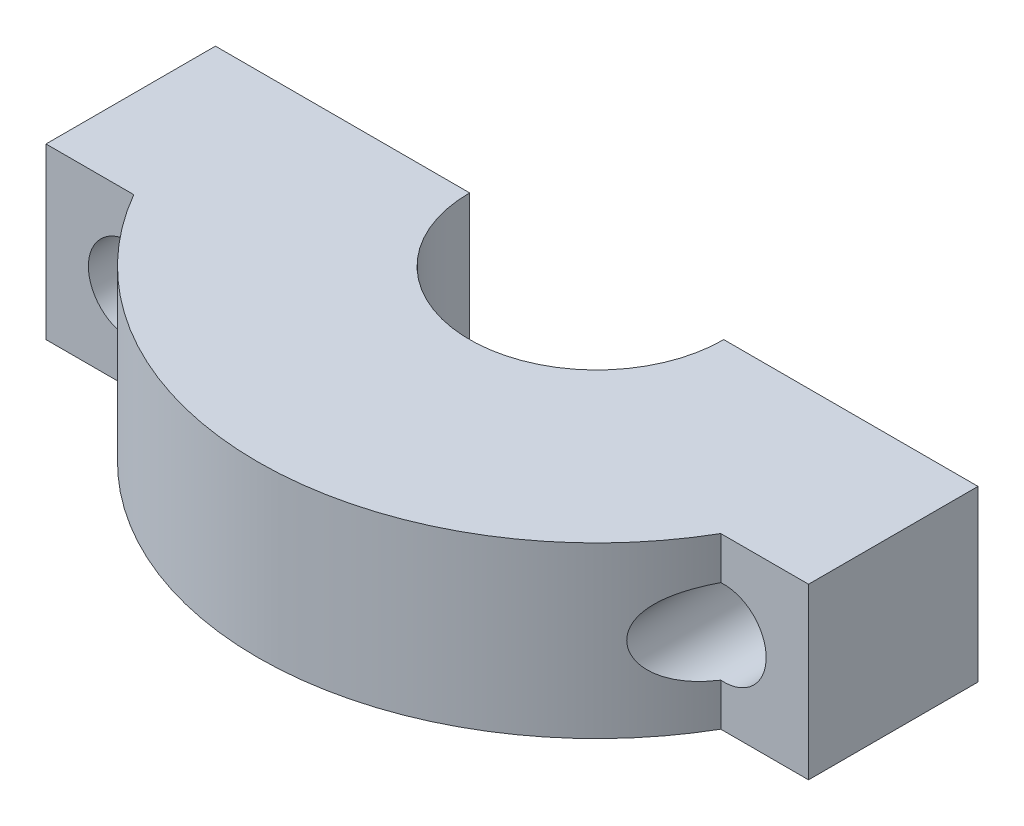
ISO-10303-21;
HEADER;
FILE_DESCRIPTION(('STEP AP214'),'2;1');
FILE_NAME('part.step','',(''),(''),'','','');
FILE_SCHEMA(('AUTOMOTIVE_DESIGN { 1 0 10303 214 1 1 1 1 }'));
ENDSEC;
DATA;
#1=APPLICATION_CONTEXT('core data for automotive mechanical design processes');
#2=APPLICATION_PROTOCOL_DEFINITION('international standard','automotive_design',2000,#1);
#3=PRODUCT_CONTEXT('',#1,'mechanical');
#4=PRODUCT('Part','Part','',(#3));
#5=PRODUCT_RELATED_PRODUCT_CATEGORY('part','',(#4));
#6=PRODUCT_DEFINITION_FORMATION('','',#4);
#7=PRODUCT_DEFINITION_CONTEXT('part definition',#1,'design');
#8=PRODUCT_DEFINITION('design','',#6,#7);
#9=PRODUCT_DEFINITION_SHAPE('','',#8);
#10=(LENGTH_UNIT() NAMED_UNIT(*) SI_UNIT(.MILLI.,.METRE.));
#11=(NAMED_UNIT(*) PLANE_ANGLE_UNIT() SI_UNIT($,.RADIAN.));
#12=(NAMED_UNIT(*) SI_UNIT($,.STERADIAN.) SOLID_ANGLE_UNIT());
#13=UNCERTAINTY_MEASURE_WITH_UNIT(LENGTH_MEASURE(1.E-05),#10,'distance_accuracy_value','');
#14=(GEOMETRIC_REPRESENTATION_CONTEXT(3) GLOBAL_UNCERTAINTY_ASSIGNED_CONTEXT((#13)) GLOBAL_UNIT_ASSIGNED_CONTEXT((#10,
#11,#12)) REPRESENTATION_CONTEXT('',''));
#15=CARTESIAN_POINT('',(0.,0.,0.));
#16=DIRECTION('',(0.,0.,1.));
#17=DIRECTION('',(1.,0.,0.));
#18=AXIS2_PLACEMENT_3D('',#15,#16,#17);
#19=CARTESIAN_POINT('',(0.,20.,20.));
#20=DIRECTION('',(0.,0.,-1.));
#21=DIRECTION('',(-1.,0.,0.));
#22=AXIS2_PLACEMENT_3D('',#19,#20,#21);
#23=PLANE('',#22);
#24=DIRECTION('',(0.,-1.,0.));
#25=VECTOR('',#24,1.);
#26=CARTESIAN_POINT('',(-34.6410161513775,20.,20.));
#27=LINE('',#26,#25);
#28=CARTESIAN_POINT('',(-34.6410161513775,5.01290359062228,20.));
#29=VERTEX_POINT('',#28);
#30=CARTESIAN_POINT('',(-34.6410161513775,0.,20.));
#31=VERTEX_POINT('',#30);
#32=EDGE_CURVE('E53',#29,#31,#27,.T.);
#33=ORIENTED_EDGE('',*,*,#32,.F.);
#34=CARTESIAN_POINT('',(-35.,10.,20.));
#35=DIRECTION('',(0.,0.,-1.));
#36=DIRECTION('',(-1.,0.,0.));
#37=AXIS2_PLACEMENT_3D('',#34,#35,#36);
#38=CIRCLE('',#37,5.);
#39=CARTESIAN_POINT('',(-34.6410161513745,14.9870964093775,20.0000000000053));
#40=VERTEX_POINT('',#39);
#41=EDGE_CURVE('E59',#29,#40,#38,.T.);
#42=ORIENTED_EDGE('',*,*,#41,.T.);
#43=CARTESIAN_POINT('',(-34.6410161513775,20.,20.));
#44=VERTEX_POINT('',#43);
#45=EDGE_CURVE('E11',#44,#40,#27,.T.);
#46=ORIENTED_EDGE('',*,*,#45,.F.);
#47=DIRECTION('',(1.,0.,0.));
#48=VECTOR('',#47,1.);
#49=CARTESIAN_POINT('',(0.,20.,20.));
#50=LINE('',#49,#48);
#51=CARTESIAN_POINT('',(-45.,20.,20.));
#52=VERTEX_POINT('',#51);
#53=EDGE_CURVE('E144',#52,#44,#50,.T.);
#54=ORIENTED_EDGE('',*,*,#53,.F.);
#55=DIRECTION('',(0.,-1.,0.));
#56=VECTOR('',#55,1.);
#57=CARTESIAN_POINT('',(-45.,20.,20.));
#58=LINE('',#57,#56);
#59=CARTESIAN_POINT('',(-45.,0.,20.));
#60=VERTEX_POINT('',#59);
#61=EDGE_CURVE('E185',#52,#60,#58,.T.);
#62=ORIENTED_EDGE('',*,*,#61,.T.);
#63=DIRECTION('',(1.,0.,0.));
#64=VECTOR('',#63,1.);
#65=CARTESIAN_POINT('',(0.,0.,20.));
#66=LINE('',#65,#64);
#67=EDGE_CURVE('E186',#60,#31,#66,.T.);
#68=ORIENTED_EDGE('',*,*,#67,.T.);
#69=EDGE_LOOP('',(#33,#42,#46,#54,#62,#68));
#70=FACE_BOUND('',#69,.T.);
#71=ADVANCED_FACE('F45',(#70),#23,.F.);
#72=CARTESIAN_POINT('',(0.,20.,0.));
#73=DIRECTION('',(0.,-1.,0.));
#74=DIRECTION('',(0.,0.,-1.));
#75=AXIS2_PLACEMENT_3D('',#72,#73,#74);
#76=CYLINDRICAL_SURFACE('',#75,40.);
#77=DIRECTION('',(0.,-1.,0.));
#78=VECTOR('',#77,1.);
#79=CARTESIAN_POINT('',(34.6410161513776,20.,20.));
#80=LINE('',#79,#78);
#81=CARTESIAN_POINT('',(34.6410161513776,5.01290359062228,20.));
#82=VERTEX_POINT('',#81);
#83=CARTESIAN_POINT('',(34.6410161513776,0.,20.));
#84=VERTEX_POINT('',#83);
#85=EDGE_CURVE('E228',#82,#84,#80,.T.);
#86=ORIENTED_EDGE('',*,*,#85,.F.);
#87=CARTESIAN_POINT('',(40.,10.,0.));
#88=CARTESIAN_POINT('',(40.,9.9998279055008,-2.47190046126606E-08));
#89=CARTESIAN_POINT('',(39.9999999911474,9.99965581077223,0.000800864393686338));
#90=CARTESIAN_POINT('',(39.9999999397677,9.9991560985,0.00270700168119621));
#91=CARTESIAN_POINT('',(39.9999998740511,9.99882836977865,0.00343404615297465));
#92=CARTESIAN_POINT('',(39.9999994903405,9.99754421897714,0.00656066357744848));
#93=CARTESIAN_POINT('',(39.9999989302323,9.99659082605299,0.00948779175975535));
#94=CARTESIAN_POINT('',(39.9999954866459,9.99265149974106,0.0212688272919127));
#95=CARTESIAN_POINT('',(39.9999901954597,9.98965893265132,0.0294756221291241));
#96=CARTESIAN_POINT('',(39.9998810957546,9.94871520772489,0.142180833480209));
#97=CARTESIAN_POINT('',(39.9993485220816,9.91081365955477,0.251466856547122));
#98=CARTESIAN_POINT('',(39.9974056861191,9.83442061306678,0.469182731514124));
#99=CARTESIAN_POINT('',(39.9959821256488,9.7959289570599,0.577573929433425));
#100=CARTESIAN_POINT('',(39.9903474807692,9.67990064539974,0.905157132911895));
#101=CARTESIAN_POINT('',(39.9847737220887,9.60241675267333,1.1250653613084));
#102=CARTESIAN_POINT('',(39.9703365304885,9.45112039795943,1.55456245920803));
#103=CARTESIAN_POINT('',(39.9616302418824,9.37729775360283,1.76417575894534));
#104=CARTESIAN_POINT('',(39.9409530540826,9.23027840446942,2.18261845639082));
#105=CARTESIAN_POINT('',(39.9289957160726,9.15708037412016,2.39144753609374));
#106=CARTESIAN_POINT('',(39.9001032472244,9.00202340826933,2.83499007127384));
#107=CARTESIAN_POINT('',(39.8827338391875,8.92022022226965,3.0696907453156));
#108=CARTESIAN_POINT('',(39.8438096528888,8.75720540730894,3.53926248741331));
#109=CARTESIAN_POINT('',(39.8222500666148,8.67599457017416,3.77413343943947));
#110=CARTESIAN_POINT('',(39.7508163037109,8.43198576297174,4.48329312886489));
#111=CARTESIAN_POINT('',(39.6944940513055,8.27047254759791,4.95739441244998));
#112=CARTESIAN_POINT('',(39.5820947785782,7.99495489411175,5.77754692594184));
#113=CARTESIAN_POINT('',(39.5300166403151,7.87984386222982,6.12378230202411));
#114=CARTESIAN_POINT('',(39.4167441007881,7.6530012999934,6.81487950238481));
#115=CARTESIAN_POINT('',(39.3555731728897,7.54126193369747,7.15974258244789));
#116=CARTESIAN_POINT('',(39.2254864094548,7.32401067674265,7.84082880194199));
#117=CARTESIAN_POINT('',(39.156784509126,7.21841432218095,8.17706583988161));
#118=CARTESIAN_POINT('',(39.0104080222068,7.01123333468589,8.84909085581892));
#119=CARTESIAN_POINT('',(38.9327272361893,6.90965153930965,9.18487835966053));
#120=CARTESIAN_POINT('',(38.7569589103481,6.69745814713723,9.90215804407074));
#121=CARTESIAN_POINT('',(38.6575353026289,6.5875474747963,10.2835317713008));
#122=CARTESIAN_POINT('',(38.4469098348601,6.37492033746572,11.0449595031631));
#123=CARTESIAN_POINT('',(38.335710032465,6.27220262084443,11.4250137264058));
#124=CARTESIAN_POINT('',(38.1005161594307,6.07436718288156,12.18649479155));
#125=CARTESIAN_POINT('',(37.9764316519615,5.97931284390281,12.5679102623475));
#126=CARTESIAN_POINT('',(37.7160730825146,5.79904560165965,13.3288989430705));
#127=CARTESIAN_POINT('',(37.5797994246853,5.71383237231397,13.7084722136369));
#128=CARTESIAN_POINT('',(37.2859732925955,5.54978606552597,14.4893420151934));
#129=CARTESIAN_POINT('',(37.1276202966661,5.47169661878623,14.8904952836562));
#130=CARTESIAN_POINT('',(36.796982799346,5.33061396811713,15.6897770679195));
#131=CARTESIAN_POINT('',(36.624697051776,5.26762211655515,16.0879053096626));
#132=CARTESIAN_POINT('',(36.2667840164395,5.15953413208649,16.8792296784654));
#133=CARTESIAN_POINT('',(36.081196247423,5.11438739054768,17.272436646077));
#134=CARTESIAN_POINT('',(35.6965448306921,5.0448993902054,18.0539824445407));
#135=CARTESIAN_POINT('',(35.4974854141435,5.02055163130025,18.4423227589087));
#136=CARTESIAN_POINT('',(35.1003267165308,4.99732354398818,19.1867857116139));
#137=CARTESIAN_POINT('',(34.9030780012357,4.99682791987585,19.543307084171));
#138=CARTESIAN_POINT('',(34.4980213707573,5.02112228680366,20.2497501745335));
#139=CARTESIAN_POINT('',(34.2902080603652,5.04592532335154,20.5996683925427));
#140=CARTESIAN_POINT('',(33.8686912963593,5.12501783907216,21.2854659996719));
#141=CARTESIAN_POINT('',(33.6551244316466,5.17885576119279,21.6214776654527));
#142=CARTESIAN_POINT('',(33.330124996286,5.28571627184832,22.1165509652102));
#143=CARTESIAN_POINT('',(33.22105257989,5.3256701191704,22.2800339004006));
#144=CARTESIAN_POINT('',(33.0017686570632,5.41512253960919,22.6035705386505));
#145=CARTESIAN_POINT('',(32.8915574109744,5.4646189750115,22.7636250008447));
#146=CARTESIAN_POINT('',(32.6829587216465,5.56792400155548,23.0619497330375));
#147=CARTESIAN_POINT('',(32.584633964924,5.62062341554228,23.200647224237));
#148=CARTESIAN_POINT('',(32.3880217905223,5.73496741745363,23.474335411928));
#149=CARTESIAN_POINT('',(32.2897343703084,5.79661121319054,23.6093264354368));
#150=CARTESIAN_POINT('',(32.0934850575852,5.92982992921299,23.8754190771132));
#151=CARTESIAN_POINT('',(31.9955254257495,6.00143807158056,24.0065058254116));
#152=CARTESIAN_POINT('',(31.80107645195,6.15523025519245,24.2635013100602));
#153=CARTESIAN_POINT('',(31.7045871188478,6.23741436015018,24.3894100152101));
#154=CARTESIAN_POINT('',(31.512911695646,6.41427425371427,24.6365815318141));
#155=CARTESIAN_POINT('',(31.4177567082955,6.50909260301499,24.7577671510366));
#156=CARTESIAN_POINT('',(31.2313103001844,6.71124780696219,24.9925534807886));
#157=CARTESIAN_POINT('',(31.1400196645105,6.81858718891968,25.106152652728));
#158=CARTESIAN_POINT('',(30.9633040882411,7.04606403191407,25.3237707975302));
#159=CARTESIAN_POINT('',(30.8778590627394,7.16615363363012,25.4278230418236));
#160=CARTESIAN_POINT('',(30.7145489314425,7.41975395404233,25.6248485579371));
#161=CARTESIAN_POINT('',(30.6366805961209,7.55325890474894,25.7178265539212));
#162=CARTESIAN_POINT('',(30.4768057604529,7.86081027900466,25.9071891807588));
#163=CARTESIAN_POINT('',(30.3968749949148,8.03771925364028,26.0008006904327));
#164=CARTESIAN_POINT('',(30.2910773925128,8.31597648478149,26.1238125554603));
#165=CARTESIAN_POINT('',(30.258154357486,8.41090499998313,26.1619234815804));
#166=CARTESIAN_POINT('',(30.1975679460175,8.60467491135068,26.2318322605907));
#167=CARTESIAN_POINT('',(30.1699024848761,8.70351473776631,26.2636326159302));
#168=CARTESIAN_POINT('',(30.1201636754038,8.90542155552193,26.3206608811109));
#169=CARTESIAN_POINT('',(30.0981403687122,9.00851754999924,26.3458300293857));
#170=CARTESIAN_POINT('',(30.0604966817369,9.21734172793896,26.3887732993438));
#171=CARTESIAN_POINT('',(30.0448731244859,9.32306857767233,26.4065510903148));
#172=CARTESIAN_POINT('',(30.0203936970193,9.53628394253061,26.4343773805243));
#173=CARTESIAN_POINT('',(30.0115359446226,9.64377195921056,26.4444280293836));
#174=CARTESIAN_POINT('',(30.0008066736178,9.85953897767697,26.4565996872647));
#175=CARTESIAN_POINT('',(29.998934395866,9.96781789223138,26.4587215579437));
#176=CARTESIAN_POINT('',(30.0020312800172,10.1717004814106,26.4552096817251));
#177=CARTESIAN_POINT('',(30.006239834906,10.2673324807883,26.4504381846447));
#178=CARTESIAN_POINT('',(30.0200800851879,10.4577231478062,26.4347290823205));
#179=CARTESIAN_POINT('',(30.0297134969098,10.5524815294011,26.42378952561));
#180=CARTESIAN_POINT('',(30.0542143570426,10.7403886111653,26.3959190488026));
#181=CARTESIAN_POINT('',(30.069079814642,10.8335379094733,26.3789904075602));
#182=CARTESIAN_POINT('',(30.1037649934854,11.0176835382249,26.3394005741208));
#183=CARTESIAN_POINT('',(30.1235866662212,11.1086790051194,26.3167371238212));
#184=CARTESIAN_POINT('',(30.1899004086659,11.3772462402071,26.2407020906195));
#185=CARTESIAN_POINT('',(30.2433107545209,11.5509119907956,26.1792074593278));
#186=CARTESIAN_POINT('',(30.3653296399985,11.8845450178642,26.0375782473402));
#187=CARTESIAN_POINT('',(30.4339440603307,12.0445069606293,25.9574364535977));
#188=CARTESIAN_POINT('',(30.620155541085,12.4251580495587,25.7378248938764));
#189=CARTESIAN_POINT('',(30.7451717657884,12.6366353352194,25.5886403679231));
#190=CARTESIAN_POINT('',(31.0125405041995,13.0259342616429,25.2639404470697));
#191=CARTESIAN_POINT('',(31.154937908814,13.2036655892327,25.0883565869839));
#192=CARTESIAN_POINT('',(31.4124337956617,13.4865601394455,24.7647020640719));
#193=CARTESIAN_POINT('',(31.5253508310886,13.5987169809365,24.6208729927673));
#194=CARTESIAN_POINT('',(31.754657300821,13.8068018602006,24.3244084019038));
#195=CARTESIAN_POINT('',(31.8710484624793,13.9027216612315,24.1717684650944));
#196=CARTESIAN_POINT('',(32.10549846609,14.079634701338,23.8594863913968));
#197=CARTESIAN_POINT('',(32.2235565933878,14.1606341396378,23.6998471968998));
#198=CARTESIAN_POINT('',(32.4601653759868,14.3091467250344,23.3747331223032));
#199=CARTESIAN_POINT('',(32.5787161893107,14.3766551387025,23.2092562178728));
#200=CARTESIAN_POINT('',(32.8941485070964,14.5403502621322,22.7616315768769));
#201=CARTESIAN_POINT('',(33.0906042472022,14.6256851980321,22.4751924811858));
#202=CARTESIAN_POINT('',(33.4790966355515,14.7675596063744,21.8923060370337));
#203=CARTESIAN_POINT('',(33.6711299699012,14.8240781155098,21.5958515693032));
#204=CARTESIAN_POINT('',(34.0507957520112,14.9129841491872,20.992184200719));
#205=CARTESIAN_POINT('',(34.2383597375935,14.9451088299465,20.6848904458325));
#206=CARTESIAN_POINT('',(34.6056303467268,14.9878484885677,20.0644043855026));
#207=CARTESIAN_POINT('',(34.7853398027611,14.9984712840654,19.75121426567));
#208=CARTESIAN_POINT('',(35.1212903689692,15.0011040671351,19.1469090223937));
#209=CARTESIAN_POINT('',(35.278227466606,14.9946203914925,18.8561821744164));
#210=CARTESIAN_POINT('',(35.5846233456078,14.9680844860457,18.2713867571991));
#211=CARTESIAN_POINT('',(35.7340808515908,14.9480299506163,17.9773176284697));
#212=CARTESIAN_POINT('',(36.025536945808,14.8959400452665,17.3859013133494));
#213=CARTESIAN_POINT('',(36.1675214329137,14.8638828907788,17.0885491264671));
#214=CARTESIAN_POINT('',(36.4436282961933,14.7891941880578,16.4915183992084));
#215=CARTESIAN_POINT('',(36.5777496579639,14.7465612791661,16.1918395642992));
#216=CARTESIAN_POINT('',(36.9565695477614,14.6088948438739,15.3167734680179));
#217=CARTESIAN_POINT('',(37.1907934864269,14.5014874663311,14.7387240810177));
#218=CARTESIAN_POINT('',(37.5197769865799,14.3204448684463,13.8694533507431));
#219=CARTESIAN_POINT('',(37.6254607567659,14.2569707121461,13.5801037910108));
#220=CARTESIAN_POINT('',(37.8297365068994,14.1240091123961,13.0002123450564));
#221=CARTESIAN_POINT('',(37.9283272644109,14.0545206369409,12.7096702623877));
#222=CARTESIAN_POINT('',(38.1666885462634,13.8735596752172,11.9798565632806));
#223=CARTESIAN_POINT('',(38.3019575601018,13.758681167618,11.5399544438455));
#224=CARTESIAN_POINT('',(38.5565094624568,13.5187792488841,10.6586051264853));
#225=CARTESIAN_POINT('',(38.6758011925349,13.3937615106454,10.2171589229829));
#226=CARTESIAN_POINT('',(38.9011903896765,13.1322796648128,9.32281250548751));
#227=CARTESIAN_POINT('',(39.0069286228128,12.9956206877467,8.86987895612984));
#228=CARTESIAN_POINT('',(39.2024061798573,12.7146176856513,7.96163764526148));
#229=CARTESIAN_POINT('',(39.29210428862,12.5702550663555,7.50632677587828));
#230=CARTESIAN_POINT('',(39.428780288757,12.3235346294136,6.74306024488239));
#231=CARTESIAN_POINT('',(39.4801621642293,12.2227925696198,6.43536087698295));
#232=CARTESIAN_POINT('',(39.575632184388,12.0189746006362,5.81949040397283));
#233=CARTESIAN_POINT('',(39.6197180175325,11.9158979635164,5.51131918045857));
#234=CARTESIAN_POINT('',(39.7002055951508,11.708881358762,4.89779835784258));
#235=CARTESIAN_POINT('',(39.7366806943227,11.6049607309525,4.59245181883906));
#236=CARTESIAN_POINT('',(39.8024985967151,11.3957156044557,3.98186785446081));
#237=CARTESIAN_POINT('',(39.8318496457212,11.2903928790908,3.6766307152114));
#238=CARTESIAN_POINT('',(39.8806403535906,11.0902969045448,3.09980519064193));
#239=CARTESIAN_POINT('',(39.9008177200151,10.9956472491493,2.82823439220211));
#240=CARTESIAN_POINT('',(39.9356840417317,10.805250652654,2.28380895206543));
#241=CARTESIAN_POINT('',(39.9503498998714,10.7095007894267,2.01095365487752));
#242=CARTESIAN_POINT('',(39.9684147439862,10.5633874329095,1.59569540917297));
#243=CARTESIAN_POINT('',(39.9738488992424,10.5131978744562,1.45325474848949));
#244=CARTESIAN_POINT('',(39.9832115527474,10.4125165545713,1.1675242592471));
#245=CARTESIAN_POINT('',(39.9871337792796,10.3620243983011,1.02423334500613));
#246=CARTESIAN_POINT('',(39.993410562863,10.2614617025194,0.739999957295029));
#247=CARTESIAN_POINT('',(39.9957801830909,10.211391909795,0.599048254819121));
#248=CARTESIAN_POINT('',(39.9989888825666,10.1120146486926,0.315804131742135));
#249=CARTESIAN_POINT('',(39.9998506610486,10.0627071519942,0.173564588014665));
#250=CARTESIAN_POINT('',(39.9999901964796,10.0103406480341,0.0294780084238295));
#251=CARTESIAN_POINT('',(39.9999954880079,10.0073477282481,0.0212671182243732));
#252=CARTESIAN_POINT('',(39.9999989307636,10.0034083123772,0.00948527039841699));
#253=CARTESIAN_POINT('',(39.9999994905628,10.0024552091108,0.00655921100931305));
#254=CARTESIAN_POINT('',(39.9999998740926,10.0011714283981,0.00343344082005648));
#255=CARTESIAN_POINT('',(39.9999999397835,10.0008437759683,0.00270653189952217));
#256=CARTESIAN_POINT('',(39.9999999911491,10.0003441566242,0.000800813672317605));
#257=CARTESIAN_POINT('',(40.,10.0001720784268,2.47166960265759E-08));
#258=CARTESIAN_POINT('',(40.,10.,0.));
#259=B_SPLINE_CURVE_WITH_KNOTS('',3,(#87,#88,#89,#90,#91,#92,#93,#94,#95,#96,#97,#98,#99,#100,
#101,#102,#103,#104,#105,#106,#107,#108,#109,#110,#111,#112,#113,#114,#115,#116,#117,#118,#119,
#120,#121,#122,#123,#124,#125,#126,#127,#128,#129,#130,#131,#132,#133,#134,#135,#136,#137,#138,
#139,#140,#141,#142,#143,#144,#145,#146,#147,#148,#149,#150,#151,#152,#153,#154,#155,#156,#157,
#158,#159,#160,#161,#162,#163,#164,#165,#166,#167,#168,#169,#170,#171,#172,#173,#174,#175,#176,
#177,#178,#179,#180,#181,#182,#183,#184,#185,#186,#187,#188,#189,#190,#191,#192,#193,#194,#195,
#196,#197,#198,#199,#200,#201,#202,#203,#204,#205,#206,#207,#208,#209,#210,#211,#212,#213,#214,
#215,#216,#217,#218,#219,#220,#221,#222,#223,#224,#225,#226,#227,#228,#229,#230,#231,#232,#233,
#234,#235,#236,#237,#238,#239,#240,#241,#242,#243,#244,#245,#246,#247,#248,#249,#250,#251,#252,
#253,#254,#255,#256,#257,#258),.UNSPECIFIED.,.T.,.F.,(4,2,2,2,2,2,2,2,2,2,2,2,2,2,2,2,2,2,2,2,2,
2,2,2,2,2,2,2,2,2,2,2,2,2,2,2,2,2,2,2,2,2,2,2,2,2,2,2,2,2,2,2,2,2,2,2,2,2,2,2,2,2,2,2,2,2,2,2,2,
2,2,2,2,2,2,2,2,2,2,2,2,2,2,2,2,4),(0.,0.00154623091854211,0.00448869176509149,
0.0130899190486982,0.0400000062659372,0.381306718255352,0.727833130823128,1.4263351595306,
2.0938061851684,2.75853459178979,3.5059830591916,4.25429430320176,5.7659886882833,
6.87157505260465,7.97435534071228,9.0514127739913,10.1292183490489,11.3564682004791,
12.5835039672567,13.8198235924047,15.0561022408311,16.370516800251,17.6850490544142,
18.9958260848521,20.3061933210017,21.5276865229,22.7498099185977,23.9534527185668,
24.5548899797484,25.1561926642011,25.6899414625931,26.2236430166466,26.7591686316124,
27.2946974729294,27.8368822670203,28.3791766885245,28.9195030648295,29.4595981114078,
30.1033856245126,30.4254518821881,30.7473901685274,31.0720919949702,31.3966324368323,
31.7210825617907,32.0454974262245,32.332675305003,32.619944092878,32.9071036919509,
33.1943765376236,33.7673692446955,34.3405839648717,35.1979923402558,36.0576639866938,
36.7003514257308,37.3433639171865,37.9861086393991,38.6290784790952,39.7003476602681,
40.7723950578524,41.8558359917271,42.9388829383297,43.9298065927372,44.9208986426787,
45.9137982985397,46.90682576548,48.8037603618863,49.7472158493891,50.6908335479159,
52.1134586019262,53.535293117295,54.9892698239239,56.4469304632659,57.4303171254602,
58.4140147515478,59.3877418955441,60.3603365588874,61.2252083116453,62.0936651138773,
62.5471631956034,63.0025227182958,63.453396284708,63.8974219862591,63.9243355386215,
63.9329341251054,63.9358759060123,63.9374219925235),.UNSPECIFIED.);
#260=CARTESIAN_POINT('',(34.6410161513776,14.9870964093777,20.));
#261=VERTEX_POINT('',#260);
#262=EDGE_CURVE('E66',#82,#261,#259,.T.);
#263=ORIENTED_EDGE('',*,*,#262,.T.);
#264=CARTESIAN_POINT('',(34.6410161513776,20.,20.));
#265=VERTEX_POINT('',#264);
#266=EDGE_CURVE('E139',#265,#261,#80,.T.);
#267=ORIENTED_EDGE('',*,*,#266,.F.);
#268=CARTESIAN_POINT('',(0.,20.,0.));
#269=DIRECTION('',(0.,1.,0.));
#270=DIRECTION('',(0.,0.,1.));
#271=AXIS2_PLACEMENT_3D('',#268,#269,#270);
#272=CIRCLE('',#271,40.);
#273=EDGE_CURVE('E136',#44,#265,#272,.T.);
#274=ORIENTED_EDGE('',*,*,#273,.F.);
#275=ORIENTED_EDGE('',*,*,#45,.T.);
#276=CARTESIAN_POINT('',(-40.,10.,0.));
#277=CARTESIAN_POINT('',(-40.,10.0001720944992,-2.47190086754575E-08));
#278=CARTESIAN_POINT('',(-39.9999999911474,10.0003441892278,0.000800864393688849));
#279=CARTESIAN_POINT('',(-39.9999999397677,10.0008439015,0.00270700168120876));
#280=CARTESIAN_POINT('',(-39.9999998740511,10.0011716302214,0.00343404615299186));
#281=CARTESIAN_POINT('',(-39.9999994903405,10.0024557810229,0.00656066357746287));
#282=CARTESIAN_POINT('',(-39.9999989302323,10.003409173947,0.00948779175976106));
#283=CARTESIAN_POINT('',(-39.9999954866459,10.0073485002589,0.0212688272919247));
#284=CARTESIAN_POINT('',(-39.9999901954597,10.0103410673487,0.0294756221291295));
#285=CARTESIAN_POINT('',(-39.9998810957546,10.0512847922755,0.142180833480228));
#286=CARTESIAN_POINT('',(-39.9993485220816,10.0891863404453,0.251466856547363));
#287=CARTESIAN_POINT('',(-39.9974056861191,10.1655793869331,0.469182731514672));
#288=CARTESIAN_POINT('',(-39.9959821256488,10.2040710429402,0.577573929434055));
#289=CARTESIAN_POINT('',(-39.9903474807692,10.3200993546006,0.90515713291279));
#290=CARTESIAN_POINT('',(-39.9847737220887,10.3975832473271,1.1250653613095));
#291=CARTESIAN_POINT('',(-39.9703365304885,10.5488796020412,1.55456245920968));
#292=CARTESIAN_POINT('',(-39.9616302418823,10.6227022463979,1.76417575894733));
#293=CARTESIAN_POINT('',(-39.9409530540825,10.7697215955315,2.18261845639347));
#294=CARTESIAN_POINT('',(-39.9289957160725,10.8429196258808,2.39144753609671));
#295=CARTESIAN_POINT('',(-39.9001032472242,10.9979765917317,2.83499007127695));
#296=CARTESIAN_POINT('',(-39.8827338391873,11.0797797777313,3.06969074531852));
#297=CARTESIAN_POINT('',(-39.8438096528886,11.2427945926919,3.53926248741586));
#298=CARTESIAN_POINT('',(-39.8222500666146,11.3240054298266,3.77413343944183));
#299=CARTESIAN_POINT('',(-39.7508163037107,11.5680142370288,4.48329312886662));
#300=CARTESIAN_POINT('',(-39.6944940513053,11.7295274524025,4.95739441245124));
#301=CARTESIAN_POINT('',(-39.5820947785781,12.0050451058885,5.77754692594249));
#302=CARTESIAN_POINT('',(-39.5300166403151,12.1201561377704,6.1237823020246));
#303=CARTESIAN_POINT('',(-39.4167441007881,12.3469987000067,6.81487950238498));
#304=CARTESIAN_POINT('',(-39.3555731728897,12.4587380663025,7.15974258244791));
#305=CARTESIAN_POINT('',(-39.2254864094548,12.6759893232573,7.84082880194189));
#306=CARTESIAN_POINT('',(-39.156784509126,12.781585677819,8.17706583988153));
#307=CARTESIAN_POINT('',(-39.0104080222068,12.9887666653141,8.84909085581888));
#308=CARTESIAN_POINT('',(-38.9327272361893,13.0903484606903,9.18487835966051));
#309=CARTESIAN_POINT('',(-38.7569589103481,13.3025418528628,9.90215804407076));
#310=CARTESIAN_POINT('',(-38.6575353026289,13.4124525252037,10.2835317713008));
#311=CARTESIAN_POINT('',(-38.4469098348601,13.6250796625343,11.0449595031631));
#312=CARTESIAN_POINT('',(-38.3357100324649,13.7277973791556,11.4250137264059));
#313=CARTESIAN_POINT('',(-38.1005161594307,13.9256328171185,12.18649479155));
#314=CARTESIAN_POINT('',(-37.9764316519615,14.0206871560972,12.5679102623476));
#315=CARTESIAN_POINT('',(-37.7160730825146,14.2009543983403,13.3288989430704));
#316=CARTESIAN_POINT('',(-37.5797994246853,14.286167627686,13.7084722136368));
#317=CARTESIAN_POINT('',(-37.2859732925956,14.450213934474,14.4893420151933));
#318=CARTESIAN_POINT('',(-37.1276202966662,14.5283033812137,14.8904952836561));
#319=CARTESIAN_POINT('',(-36.796982799346,14.6693860318829,15.6897770679194));
#320=CARTESIAN_POINT('',(-36.6246970517761,14.7323778834448,16.0879053096625));
#321=CARTESIAN_POINT('',(-36.2667840164395,14.8404658679135,16.8792296784653));
#322=CARTESIAN_POINT('',(-36.081196247423,14.8856126094523,17.272436646077));
#323=CARTESIAN_POINT('',(-35.6965448306921,14.9551006097946,18.0539824445407));
#324=CARTESIAN_POINT('',(-35.4974854141435,14.9794483686998,18.4423227589087));
#325=CARTESIAN_POINT('',(-35.1003267165308,15.0026764560118,19.1867857116139));
#326=CARTESIAN_POINT('',(-34.9030780012357,15.0031720801242,19.543307084171));
#327=CARTESIAN_POINT('',(-34.4980213707573,14.9788777131963,20.2497501745335));
#328=CARTESIAN_POINT('',(-34.2902080603652,14.9540746766485,20.5996683925427));
#329=CARTESIAN_POINT('',(-33.8686912963593,14.8749821609278,21.2854659996719));
#330=CARTESIAN_POINT('',(-33.6551244316466,14.8211442388072,21.6214776654527));
#331=CARTESIAN_POINT('',(-33.330124996286,14.7142837281517,22.1165509652102));
#332=CARTESIAN_POINT('',(-33.22105257989,14.6743298808296,22.2800339004006));
#333=CARTESIAN_POINT('',(-33.0017686570632,14.5848774603908,22.6035705386505));
#334=CARTESIAN_POINT('',(-32.8915574109744,14.5353810249885,22.7636250008447));
#335=CARTESIAN_POINT('',(-32.6829587216465,14.4320759984445,23.0619497330375));
#336=CARTESIAN_POINT('',(-32.5846339649239,14.3793765844577,23.200647224237));
#337=CARTESIAN_POINT('',(-32.3880217905222,14.2650325825464,23.474335411928));
#338=CARTESIAN_POINT('',(-32.2897343703084,14.2033887868095,23.6093264354368));
#339=CARTESIAN_POINT('',(-32.0934850575851,14.070170070787,23.8754190771132));
#340=CARTESIAN_POINT('',(-31.9955254257495,13.9985619284194,24.0065058254116));
#341=CARTESIAN_POINT('',(-31.80107645195,13.8447697448076,24.2635013100602));
#342=CARTESIAN_POINT('',(-31.7045871188477,13.7625856398498,24.3894100152101));
#343=CARTESIAN_POINT('',(-31.512911695646,13.5857257462857,24.6365815318141));
#344=CARTESIAN_POINT('',(-31.4177567082955,13.490907396985,24.7577671510367));
#345=CARTESIAN_POINT('',(-31.2313103001844,13.2887521930378,24.9925534807887));
#346=CARTESIAN_POINT('',(-31.1400196645105,13.1814128110803,25.106152652728));
#347=CARTESIAN_POINT('',(-30.9633040882411,12.9539359680859,25.3237707975302));
#348=CARTESIAN_POINT('',(-30.8778590627393,12.8338463663699,25.4278230418237));
#349=CARTESIAN_POINT('',(-30.7145489314425,12.5802460459577,25.6248485579371));
#350=CARTESIAN_POINT('',(-30.6366805961209,12.4467410952511,25.7178265539212));
#351=CARTESIAN_POINT('',(-30.4768057604529,12.1391897209953,25.9071891807588));
#352=CARTESIAN_POINT('',(-30.3968749949148,11.9622807463597,26.0008006904328));
#353=CARTESIAN_POINT('',(-30.2910773925128,11.6840235152185,26.1238125554604));
#354=CARTESIAN_POINT('',(-30.258154357486,11.5890950000169,26.1619234815805));
#355=CARTESIAN_POINT('',(-30.1975679460175,11.3953250886493,26.2318322605907));
#356=CARTESIAN_POINT('',(-30.1699024848761,11.2964852622337,26.2636326159302));
#357=CARTESIAN_POINT('',(-30.1201636754038,11.0945784444781,26.3206608811109));
#358=CARTESIAN_POINT('',(-30.0981403687122,10.9914824500008,26.3458300293857));
#359=CARTESIAN_POINT('',(-30.0604966817369,10.782658272061,26.3887732993438));
#360=CARTESIAN_POINT('',(-30.0448731244859,10.6769314223277,26.4065510903148));
#361=CARTESIAN_POINT('',(-30.0203936970193,10.4637160574694,26.4343773805243));
#362=CARTESIAN_POINT('',(-30.0115359446225,10.3562280407894,26.4444280293836));
#363=CARTESIAN_POINT('',(-30.0008066736178,10.140461022323,26.4565996872647));
#364=CARTESIAN_POINT('',(-29.998934395866,10.0321821077686,26.4587215579437));
#365=CARTESIAN_POINT('',(-30.0020312800172,9.8282995185894,26.4552096817251));
#366=CARTESIAN_POINT('',(-30.006239834906,9.73266751921171,26.4504381846448));
#367=CARTESIAN_POINT('',(-30.0200800851879,9.54227685219376,26.4347290823205));
#368=CARTESIAN_POINT('',(-30.0297134969098,9.44751847059893,26.42378952561));
#369=CARTESIAN_POINT('',(-30.0542143570426,9.25961138883467,26.3959190488026));
#370=CARTESIAN_POINT('',(-30.069079814642,9.1664620905267,26.3789904075602));
#371=CARTESIAN_POINT('',(-30.1037649934854,8.98231646177511,26.3394005741208));
#372=CARTESIAN_POINT('',(-30.1235866662212,8.8913209948806,26.3167371238212));
#373=CARTESIAN_POINT('',(-30.1899004086659,8.62275375979288,26.2407020906195));
#374=CARTESIAN_POINT('',(-30.2433107545209,8.44908800920438,26.1792074593278));
#375=CARTESIAN_POINT('',(-30.3653296399985,8.11545498213579,26.0375782473402));
#376=CARTESIAN_POINT('',(-30.4339440603307,7.95549303937069,25.9574364535978));
#377=CARTESIAN_POINT('',(-30.620155541085,7.57484195044131,25.7378248938765));
#378=CARTESIAN_POINT('',(-30.7451717657884,7.36336466478057,25.5886403679231));
#379=CARTESIAN_POINT('',(-31.0125405041995,6.97406573835706,25.2639404470697));
#380=CARTESIAN_POINT('',(-31.154937908814,6.79633441076732,25.0883565869839));
#381=CARTESIAN_POINT('',(-31.4124337956617,6.51343986055451,24.7647020640719));
#382=CARTESIAN_POINT('',(-31.5253508310886,6.40128301906345,24.6208729927673));
#383=CARTESIAN_POINT('',(-31.754657300821,6.19319813979939,24.3244084019038));
#384=CARTESIAN_POINT('',(-31.8710484624793,6.09727833876851,24.1717684650944));
#385=CARTESIAN_POINT('',(-32.1054984660901,5.92036529866194,23.8594863913968));
#386=CARTESIAN_POINT('',(-32.2235565933879,5.83936586036223,23.6998471968998));
#387=CARTESIAN_POINT('',(-32.4601653759868,5.69085327496556,23.3747331223032));
#388=CARTESIAN_POINT('',(-32.5787161893107,5.62334486129746,23.2092562178728));
#389=CARTESIAN_POINT('',(-32.8941485070964,5.45964973786784,22.7616315768768));
#390=CARTESIAN_POINT('',(-33.0906042472023,5.37431480196787,22.4751924811858));
#391=CARTESIAN_POINT('',(-33.4790966355515,5.23244039362557,21.8923060370337));
#392=CARTESIAN_POINT('',(-33.6711299699012,5.17592188449017,21.5958515693031));
#393=CARTESIAN_POINT('',(-34.0507957520113,5.08701585081277,20.9921842007189));
#394=CARTESIAN_POINT('',(-34.2383597375935,5.0548911700535,20.6848904458325));
#395=CARTESIAN_POINT('',(-34.6056303467269,5.01215151143229,20.0644043855026));
#396=CARTESIAN_POINT('',(-34.7853398027611,5.00152871593457,19.75121426567));
#397=CARTESIAN_POINT('',(-35.1212903689693,4.99889593286494,19.1469090223936));
#398=CARTESIAN_POINT('',(-35.2782274666061,5.00537960850748,18.8561821744163));
#399=CARTESIAN_POINT('',(-35.5846233456079,5.03191551395435,18.2713867571989));
#400=CARTESIAN_POINT('',(-35.7340808515909,5.05197004938372,17.9773176284695));
#401=CARTESIAN_POINT('',(-36.0255369458081,5.10405995473353,17.3859013133492));
#402=CARTESIAN_POINT('',(-36.1675214329138,5.13611710922123,17.0885491264669));
#403=CARTESIAN_POINT('',(-36.4436282961935,5.21080581194226,16.4915183992082));
#404=CARTESIAN_POINT('',(-36.577749657964,5.25343872083399,16.191839564299));
#405=CARTESIAN_POINT('',(-36.9565695477615,5.39110515612614,15.3167734680177));
#406=CARTESIAN_POINT('',(-37.1907934864269,5.49851253366894,14.7387240810176));
#407=CARTESIAN_POINT('',(-37.5197769865799,5.67955513155371,13.8694533507431));
#408=CARTESIAN_POINT('',(-37.6254607567659,5.74302928785395,13.5801037910108));
#409=CARTESIAN_POINT('',(-37.8297365068994,5.87599088760396,13.0002123450564));
#410=CARTESIAN_POINT('',(-37.928327264411,5.94547936305918,12.7096702623876));
#411=CARTESIAN_POINT('',(-38.1666885462635,6.12644032478292,11.9798565632803));
#412=CARTESIAN_POINT('',(-38.3019575601019,6.24131883238218,11.5399544438451));
#413=CARTESIAN_POINT('',(-38.556509462457,6.48122075111607,10.6586051264845));
#414=CARTESIAN_POINT('',(-38.6758011925351,6.60623848935485,10.217158922982));
#415=CARTESIAN_POINT('',(-38.9011903896767,6.86772033518749,9.32281250548658));
#416=CARTESIAN_POINT('',(-39.006928622813,7.00437931225354,8.86987895612898));
#417=CARTESIAN_POINT('',(-39.2024061798575,7.28538231434898,7.96163764526073));
#418=CARTESIAN_POINT('',(-39.2921042886202,7.42974493364475,7.50632677587757));
#419=CARTESIAN_POINT('',(-39.4287802887571,7.6764653705865,6.74306024488195));
#420=CARTESIAN_POINT('',(-39.4801621642293,7.77720743038028,6.43536087698275));
#421=CARTESIAN_POINT('',(-39.5756321843879,7.98102539936373,5.81949040397309));
#422=CARTESIAN_POINT('',(-39.6197180175325,8.08410203648345,5.51131918045907));
#423=CARTESIAN_POINT('',(-39.7002055951507,8.29111864123769,4.89779835784358));
#424=CARTESIAN_POINT('',(-39.7366806943225,8.39503926904708,4.59245181884033));
#425=CARTESIAN_POINT('',(-39.8024985967149,8.60428439554371,3.98186785446258));
#426=CARTESIAN_POINT('',(-39.831849645721,8.7096071209085,3.67663071521341));
#427=CARTESIAN_POINT('',(-39.8806403535905,8.9097030954545,3.09980519064386));
#428=CARTESIAN_POINT('',(-39.9008177200149,9.00435275085013,2.82823439220374));
#429=CARTESIAN_POINT('',(-39.9356840417316,9.19474934734564,2.28380895206647));
#430=CARTESIAN_POINT('',(-39.9503498998714,9.29049921057307,2.01095365487829));
#431=CARTESIAN_POINT('',(-39.9684147439862,9.43661256709029,1.59569540917341));
#432=CARTESIAN_POINT('',(-39.9738488992424,9.48680212554349,1.45325474848988));
#433=CARTESIAN_POINT('',(-39.9832115527473,9.5874834454287,1.16752425924758));
#434=CARTESIAN_POINT('',(-39.9871337792796,9.63797560169929,1.02423334500673));
#435=CARTESIAN_POINT('',(-39.993410562863,9.73853829747989,0.739999957295178));
#436=CARTESIAN_POINT('',(-39.9957801830909,9.78860809020277,0.5990482548187));
#437=CARTESIAN_POINT('',(-39.9989888825666,9.88798535130963,0.315804131743163));
#438=CARTESIAN_POINT('',(-39.9998506610486,9.93729284801383,0.173564588017671));
#439=CARTESIAN_POINT('',(-39.9999901964796,9.98965935196549,0.0294780084236863));
#440=CARTESIAN_POINT('',(-39.9999954880079,9.99265227175103,0.0212671182240365));
#441=CARTESIAN_POINT('',(-39.9999989307636,9.99659168762231,0.00948527039820522));
#442=CARTESIAN_POINT('',(-39.9999994905628,9.99754479088884,0.00655921100915388));
#443=CARTESIAN_POINT('',(-39.9999998740926,9.99882857160175,0.00343344081995984));
#444=CARTESIAN_POINT('',(-39.9999999397835,9.99915622403163,0.00270653189944406));
#445=CARTESIAN_POINT('',(-39.9999999911491,9.99965584337578,0.000800813672292238));
#446=CARTESIAN_POINT('',(-40.,9.99982792157323,2.47167000883123E-08));
#447=CARTESIAN_POINT('',(-40.,10.,0.));
#448=B_SPLINE_CURVE_WITH_KNOTS('',3,(#276,#277,#278,#279,#280,#281,#282,#283,#284,#285,#286,
#287,#288,#289,#290,#291,#292,#293,#294,#295,#296,#297,#298,#299,#300,#301,#302,#303,#304,#305,
#306,#307,#308,#309,#310,#311,#312,#313,#314,#315,#316,#317,#318,#319,#320,#321,#322,#323,#324,
#325,#326,#327,#328,#329,#330,#331,#332,#333,#334,#335,#336,#337,#338,#339,#340,#341,#342,#343,
#344,#345,#346,#347,#348,#349,#350,#351,#352,#353,#354,#355,#356,#357,#358,#359,#360,#361,#362,
#363,#364,#365,#366,#367,#368,#369,#370,#371,#372,#373,#374,#375,#376,#377,#378,#379,#380,#381,
#382,#383,#384,#385,#386,#387,#388,#389,#390,#391,#392,#393,#394,#395,#396,#397,#398,#399,#400,
#401,#402,#403,#404,#405,#406,#407,#408,#409,#410,#411,#412,#413,#414,#415,#416,#417,#418,#419,
#420,#421,#422,#423,#424,#425,#426,#427,#428,#429,#430,#431,#432,#433,#434,#435,#436,#437,#438,
#439,#440,#441,#442,#443,#444,#445,#446,#447),.UNSPECIFIED.,.T.,.F.,(4,2,2,2,2,2,2,2,2,2,2,2,2,
2,2,2,2,2,2,2,2,2,2,2,2,2,2,2,2,2,2,2,2,2,2,2,2,2,2,2,2,2,2,2,2,2,2,2,2,2,2,2,2,2,2,2,2,2,2,2,2,
2,2,2,2,2,2,2,2,2,2,2,2,2,2,2,2,2,2,2,2,2,2,2,2,4),(0.,0.00154623091855933,0.0044886917651288,
0.0130899190486911,0.0400000062659372,0.381306718255729,0.727833130823859,1.42633515953202,
2.09380618517085,2.75853459179327,3.50598305919449,4.25429430320406,5.76598868828417,
6.871575052605,7.97435534071214,9.05141277399123,10.1292183490489,11.3564682004792,
12.5835039672568,13.8198235924047,15.0561022408309,16.3705168002509,17.6850490544141,
18.995826084852,20.3061933210017,21.5276865229,22.7498099185977,23.9534527185668,
24.5548899797484,25.1561926642011,25.6899414625931,26.2236430166467,26.7591686316124,
27.2946974729294,27.8368822670203,28.3791766885246,28.9195030648295,29.4595981114078,
30.1033856245126,30.4254518821881,30.7473901685274,31.0720919949702,31.3966324368323,
31.7210825617907,32.0454974262246,32.3326753050031,32.619944092878,32.907103691951,
33.1943765376236,33.7673692446955,34.3405839648718,35.1979923402558,36.0576639866938,
36.7003514257309,37.3433639171866,37.9861086393992,38.6290784790953,39.7003476602681,
40.7723950578525,41.8558359917271,42.9388829383298,43.9298065927374,44.920898642679,
45.91379829854,46.9068257654803,48.8037603618863,49.7472158493892,50.6908335479161,
52.1134586019269,53.5352931172961,54.9892698239248,56.4469304632667,57.4303171254602,
58.4140147515471,59.3877418955425,60.3603365588851,61.2252083116439,62.0936651138769,
62.5471631956029,63.0025227182954,63.4533962847077,63.8974219862592,63.9243355386216,
63.9329341251055,63.9358759060124,63.9374219925235),.UNSPECIFIED.);
#449=EDGE_CURVE('E119',#40,#29,#448,.T.);
#450=ORIENTED_EDGE('',*,*,#449,.T.);
#451=ORIENTED_EDGE('',*,*,#32,.T.);
#452=CARTESIAN_POINT('',(0.,0.,0.));
#453=DIRECTION('',(0.,1.,0.));
#454=DIRECTION('',(0.,0.,1.));
#455=AXIS2_PLACEMENT_3D('',#452,#453,#454);
#456=CIRCLE('',#455,40.);
#457=EDGE_CURVE('E189',#31,#84,#456,.T.);
#458=ORIENTED_EDGE('',*,*,#457,.T.);
#459=EDGE_LOOP('',(#86,#263,#267,#274,#275,#450,#451,#458));
#460=FACE_BOUND('',#459,.T.);
#461=ADVANCED_FACE('F134',(#460),#76,.T.);
#462=CARTESIAN_POINT('',(0.,20.,20.));
#463=DIRECTION('',(0.,0.,-1.));
#464=DIRECTION('',(-1.,0.,0.));
#465=AXIS2_PLACEMENT_3D('',#462,#463,#464);
#466=PLANE('',#465);
#467=ORIENTED_EDGE('',*,*,#266,.T.);
#468=CARTESIAN_POINT('',(35.,10.,20.));
#469=DIRECTION('',(0.,0.,-1.));
#470=DIRECTION('',(-1.,0.,0.));
#471=AXIS2_PLACEMENT_3D('',#468,#469,#470);
#472=CIRCLE('',#471,5.);
#473=EDGE_CURVE('E131',#261,#82,#472,.T.);
#474=ORIENTED_EDGE('',*,*,#473,.T.);
#475=ORIENTED_EDGE('',*,*,#85,.T.);
#476=DIRECTION('',(1.,0.,0.));
#477=VECTOR('',#476,1.);
#478=CARTESIAN_POINT('',(0.,0.,20.));
#479=LINE('',#478,#477);
#480=CARTESIAN_POINT('',(45.,0.,20.));
#481=VERTEX_POINT('',#480);
#482=EDGE_CURVE('E193',#84,#481,#479,.T.);
#483=ORIENTED_EDGE('',*,*,#482,.T.);
#484=DIRECTION('',(0.,-1.,0.));
#485=VECTOR('',#484,1.);
#486=CARTESIAN_POINT('',(45.,20.,20.));
#487=LINE('',#486,#485);
#488=CARTESIAN_POINT('',(45.,20.,20.));
#489=VERTEX_POINT('',#488);
#490=EDGE_CURVE('E225',#489,#481,#487,.T.);
#491=ORIENTED_EDGE('',*,*,#490,.F.);
#492=DIRECTION('',(1.,0.,0.));
#493=VECTOR('',#492,1.);
#494=CARTESIAN_POINT('',(0.,20.,20.));
#495=LINE('',#494,#493);
#496=EDGE_CURVE('E143',#265,#489,#495,.T.);
#497=ORIENTED_EDGE('',*,*,#496,.F.);
#498=EDGE_LOOP('',(#467,#474,#475,#483,#491,#497));
#499=FACE_BOUND('',#498,.T.);
#500=ADVANCED_FACE('F233',(#499),#466,.F.);
#501=CARTESIAN_POINT('',(45.,20.,0.));
#502=DIRECTION('',(-1.,0.,0.));
#503=DIRECTION('',(0.,0.,1.));
#504=AXIS2_PLACEMENT_3D('',#501,#502,#503);
#505=PLANE('',#504);
#506=DIRECTION('',(0.,0.,-1.));
#507=VECTOR('',#506,1.);
#508=CARTESIAN_POINT('',(45.,0.,0.));
#509=LINE('',#508,#507);
#510=CARTESIAN_POINT('',(45.,0.,0.));
#511=VERTEX_POINT('',#510);
#512=EDGE_CURVE('E196',#481,#511,#509,.T.);
#513=ORIENTED_EDGE('',*,*,#512,.T.);
#514=DIRECTION('',(0.,-1.,0.));
#515=VECTOR('',#514,1.);
#516=CARTESIAN_POINT('',(45.,20.,0.));
#517=LINE('',#516,#515);
#518=CARTESIAN_POINT('',(45.,20.,0.));
#519=VERTEX_POINT('',#518);
#520=EDGE_CURVE('E222',#519,#511,#517,.T.);
#521=ORIENTED_EDGE('',*,*,#520,.F.);
#522=DIRECTION('',(0.,0.,-1.));
#523=VECTOR('',#522,1.);
#524=CARTESIAN_POINT('',(45.,20.,0.));
#525=LINE('',#524,#523);
#526=EDGE_CURVE('E168',#489,#519,#525,.T.);
#527=ORIENTED_EDGE('',*,*,#526,.F.);
#528=ORIENTED_EDGE('',*,*,#490,.T.);
#529=EDGE_LOOP('',(#513,#521,#527,#528));
#530=FACE_BOUND('',#529,.T.);
#531=ADVANCED_FACE('F244',(#530),#505,.F.);
#532=CARTESIAN_POINT('',(0.,20.,0.));
#533=DIRECTION('',(0.,0.,-1.));
#534=DIRECTION('',(-1.,0.,0.));
#535=AXIS2_PLACEMENT_3D('',#532,#533,#534);
#536=PLANE('',#535);
#537=CARTESIAN_POINT('',(35.,10.,0.));
#538=DIRECTION('',(0.,0.,-1.));
#539=DIRECTION('',(-1.,0.,0.));
#540=AXIS2_PLACEMENT_3D('',#537,#538,#539);
#541=CIRCLE('',#540,5.);
#542=CARTESIAN_POINT('',(30.,10.,0.));
#543=VERTEX_POINT('',#542);
#544=EDGE_CURVE('E124',#543,#543,#541,.T.);
#545=ORIENTED_EDGE('',*,*,#544,.F.);
#546=EDGE_LOOP('',(#545));
#547=FACE_BOUND('',#546,.T.);
#548=DIRECTION('',(1.,0.,0.));
#549=VECTOR('',#548,1.);
#550=CARTESIAN_POINT('',(0.,0.,0.));
#551=LINE('',#550,#549);
#552=CARTESIAN_POINT('',(15.,0.,0.));
#553=VERTEX_POINT('',#552);
#554=EDGE_CURVE('E200',#553,#511,#551,.T.);
#555=ORIENTED_EDGE('',*,*,#554,.F.);
#556=DIRECTION('',(0.,-1.,0.));
#557=VECTOR('',#556,1.);
#558=CARTESIAN_POINT('',(15.,20.,0.));
#559=LINE('',#558,#557);
#560=CARTESIAN_POINT('',(15.,20.,0.));
#561=VERTEX_POINT('',#560);
#562=EDGE_CURVE('E219',#561,#553,#559,.T.);
#563=ORIENTED_EDGE('',*,*,#562,.F.);
#564=DIRECTION('',(1.,0.,0.));
#565=VECTOR('',#564,1.);
#566=CARTESIAN_POINT('',(0.,20.,0.));
#567=LINE('',#566,#565);
#568=EDGE_CURVE('E171',#561,#519,#567,.T.);
#569=ORIENTED_EDGE('',*,*,#568,.T.);
#570=ORIENTED_EDGE('',*,*,#520,.T.);
#571=EDGE_LOOP('',(#555,#563,#569,#570));
#572=FACE_BOUND('',#571,.T.);
#573=ADVANCED_FACE('F352',(#547,#572),#536,.T.);
#574=CARTESIAN_POINT('',(0.,20.,0.));
#575=DIRECTION('',(0.,-1.,0.));
#576=DIRECTION('',(0.,0.,-1.));
#577=AXIS2_PLACEMENT_3D('',#574,#575,#576);
#578=CYLINDRICAL_SURFACE('',#577,15.);
#579=CARTESIAN_POINT('',(0.,0.,0.));
#580=DIRECTION('',(0.,1.,0.));
#581=DIRECTION('',(0.,0.,1.));
#582=AXIS2_PLACEMENT_3D('',#579,#580,#581);
#583=CIRCLE('',#582,15.);
#584=CARTESIAN_POINT('',(-15.,0.,0.));
#585=VERTEX_POINT('',#584);
#586=EDGE_CURVE('E204',#585,#553,#583,.T.);
#587=ORIENTED_EDGE('',*,*,#586,.F.);
#588=DIRECTION('',(0.,-1.,0.));
#589=VECTOR('',#588,1.);
#590=CARTESIAN_POINT('',(-15.,20.,0.));
#591=LINE('',#590,#589);
#592=CARTESIAN_POINT('',(-15.,20.,0.));
#593=VERTEX_POINT('',#592);
#594=EDGE_CURVE('E216',#593,#585,#591,.T.);
#595=ORIENTED_EDGE('',*,*,#594,.F.);
#596=CARTESIAN_POINT('',(0.,20.,0.));
#597=DIRECTION('',(0.,1.,0.));
#598=DIRECTION('',(0.,0.,1.));
#599=AXIS2_PLACEMENT_3D('',#596,#597,#598);
#600=CIRCLE('',#599,15.);
#601=EDGE_CURVE('E175',#593,#561,#600,.T.);
#602=ORIENTED_EDGE('',*,*,#601,.T.);
#603=ORIENTED_EDGE('',*,*,#562,.T.);
#604=EDGE_LOOP('',(#587,#595,#602,#603));
#605=FACE_BOUND('',#604,.T.);
#606=ADVANCED_FACE('F251',(#605),#578,.F.);
#607=CARTESIAN_POINT('',(0.,20.,0.));
#608=DIRECTION('',(0.,0.,-1.));
#609=DIRECTION('',(-1.,0.,0.));
#610=AXIS2_PLACEMENT_3D('',#607,#608,#609);
#611=PLANE('',#610);
#612=CARTESIAN_POINT('',(-35.,10.,0.));
#613=DIRECTION('',(0.,0.,-1.));
#614=DIRECTION('',(1.,0.,0.));
#615=AXIS2_PLACEMENT_3D('',#612,#613,#614);
#616=CIRCLE('',#615,5.);
#617=CARTESIAN_POINT('',(-30.,10.,0.));
#618=VERTEX_POINT('',#617);
#619=EDGE_CURVE('E285',#618,#618,#616,.T.);
#620=ORIENTED_EDGE('',*,*,#619,.F.);
#621=EDGE_LOOP('',(#620));
#622=FACE_BOUND('',#621,.T.);
#623=DIRECTION('',(1.,0.,0.));
#624=VECTOR('',#623,1.);
#625=CARTESIAN_POINT('',(0.,0.,0.));
#626=LINE('',#625,#624);
#627=CARTESIAN_POINT('',(-45.,0.,0.));
#628=VERTEX_POINT('',#627);
#629=EDGE_CURVE('E156',#628,#585,#626,.T.);
#630=ORIENTED_EDGE('',*,*,#629,.F.);
#631=DIRECTION('',(0.,-1.,0.));
#632=VECTOR('',#631,1.);
#633=CARTESIAN_POINT('',(-45.,20.,0.));
#634=LINE('',#633,#632);
#635=CARTESIAN_POINT('',(-45.,20.,0.));
#636=VERTEX_POINT('',#635);
#637=EDGE_CURVE('E213',#636,#628,#634,.T.);
#638=ORIENTED_EDGE('',*,*,#637,.F.);
#639=DIRECTION('',(1.,0.,0.));
#640=VECTOR('',#639,1.);
#641=CARTESIAN_POINT('',(0.,20.,0.));
#642=LINE('',#641,#640);
#643=EDGE_CURVE('E179',#636,#593,#642,.T.);
#644=ORIENTED_EDGE('',*,*,#643,.T.);
#645=ORIENTED_EDGE('',*,*,#594,.T.);
#646=EDGE_LOOP('',(#630,#638,#644,#645));
#647=FACE_BOUND('',#646,.T.);
#648=ADVANCED_FACE('F254',(#622,#647),#611,.T.);
#649=CARTESIAN_POINT('',(-45.,20.,0.));
#650=DIRECTION('',(1.,0.,0.));
#651=DIRECTION('',(0.,0.,-1.));
#652=AXIS2_PLACEMENT_3D('',#649,#650,#651);
#653=PLANE('',#652);
#654=DIRECTION('',(0.,0.,1.));
#655=VECTOR('',#654,1.);
#656=CARTESIAN_POINT('',(-45.,0.,0.));
#657=LINE('',#656,#655);
#658=EDGE_CURVE('E153',#628,#60,#657,.T.);
#659=ORIENTED_EDGE('',*,*,#658,.T.);
#660=ORIENTED_EDGE('',*,*,#61,.F.);
#661=DIRECTION('',(0.,0.,1.));
#662=VECTOR('',#661,1.);
#663=CARTESIAN_POINT('',(-45.,20.,0.));
#664=LINE('',#663,#662);
#665=EDGE_CURVE('E149',#636,#52,#664,.T.);
#666=ORIENTED_EDGE('',*,*,#665,.F.);
#667=ORIENTED_EDGE('',*,*,#637,.T.);
#668=EDGE_LOOP('',(#659,#660,#666,#667));
#669=FACE_BOUND('',#668,.T.);
#670=ADVANCED_FACE('F257',(#669),#653,.F.);
#671=CARTESIAN_POINT('',(0.,20.,0.));
#672=DIRECTION('',(0.,1.,0.));
#673=DIRECTION('',(0.,0.,1.));
#674=AXIS2_PLACEMENT_3D('',#671,#672,#673);
#675=PLANE('',#674);
#676=ORIENTED_EDGE('',*,*,#53,.T.);
#677=ORIENTED_EDGE('',*,*,#273,.T.);
#678=ORIENTED_EDGE('',*,*,#496,.T.);
#679=ORIENTED_EDGE('',*,*,#526,.T.);
#680=ORIENTED_EDGE('',*,*,#568,.F.);
#681=ORIENTED_EDGE('',*,*,#601,.F.);
#682=ORIENTED_EDGE('',*,*,#643,.F.);
#683=ORIENTED_EDGE('',*,*,#665,.T.);
#684=EDGE_LOOP('',(#676,#677,#678,#679,#680,#681,#682,#683));
#685=FACE_BOUND('',#684,.T.);
#686=ADVANCED_FACE('F146',(#685),#675,.T.);
#687=CARTESIAN_POINT('',(0.,0.,0.));
#688=DIRECTION('',(0.,1.,0.));
#689=DIRECTION('',(0.,0.,1.));
#690=AXIS2_PLACEMENT_3D('',#687,#688,#689);
#691=PLANE('',#690);
#692=ORIENTED_EDGE('',*,*,#67,.F.);
#693=ORIENTED_EDGE('',*,*,#658,.F.);
#694=ORIENTED_EDGE('',*,*,#629,.T.);
#695=ORIENTED_EDGE('',*,*,#586,.T.);
#696=ORIENTED_EDGE('',*,*,#554,.T.);
#697=ORIENTED_EDGE('',*,*,#512,.F.);
#698=ORIENTED_EDGE('',*,*,#482,.F.);
#699=ORIENTED_EDGE('',*,*,#457,.F.);
#700=EDGE_LOOP('',(#692,#693,#694,#695,#696,#697,#698,#699));
#701=FACE_BOUND('',#700,.T.);
#702=ADVANCED_FACE('F240',(#701),#691,.F.);
#703=CARTESIAN_POINT('',(-35.,10.,40.));
#704=DIRECTION('',(0.,0.,-1.));
#705=DIRECTION('',(-1.,0.,0.));
#706=AXIS2_PLACEMENT_3D('',#703,#704,#705);
#707=CYLINDRICAL_SURFACE('',#706,5.);
#708=ORIENTED_EDGE('',*,*,#619,.T.);
#709=EDGE_LOOP('',(#708));
#710=FACE_BOUND('',#709,.T.);
#711=ORIENTED_EDGE('',*,*,#449,.F.);
#712=ORIENTED_EDGE('',*,*,#41,.F.);
#713=EDGE_LOOP('',(#711,#712));
#714=FACE_BOUND('',#713,.T.);
#715=ADVANCED_FACE('F120',(#710,#714),#707,.F.);
#716=CARTESIAN_POINT('',(35.,10.,40.));
#717=DIRECTION('',(0.,0.,-1.));
#718=DIRECTION('',(-1.,0.,0.));
#719=AXIS2_PLACEMENT_3D('',#716,#717,#718);
#720=CYLINDRICAL_SURFACE('',#719,5.);
#721=ORIENTED_EDGE('',*,*,#544,.T.);
#722=EDGE_LOOP('',(#721));
#723=FACE_BOUND('',#722,.T.);
#724=ORIENTED_EDGE('',*,*,#473,.F.);
#725=ORIENTED_EDGE('',*,*,#262,.F.);
#726=EDGE_LOOP('',(#724,#725));
#727=FACE_BOUND('',#726,.T.);
#728=ADVANCED_FACE('F289',(#723,#727),#720,.F.);
#729=CLOSED_SHELL('',(#71,#461,#500,#531,#573,#606,#648,#670,#686,#702,#715,#728));
#730=MANIFOLD_SOLID_BREP('B2',#729);
#731=ADVANCED_BREP_SHAPE_REPRESENTATION('',(#18,#730),#14);
#732=SHAPE_DEFINITION_REPRESENTATION(#9,#731);
ENDSEC;
END-ISO-10303-21;
